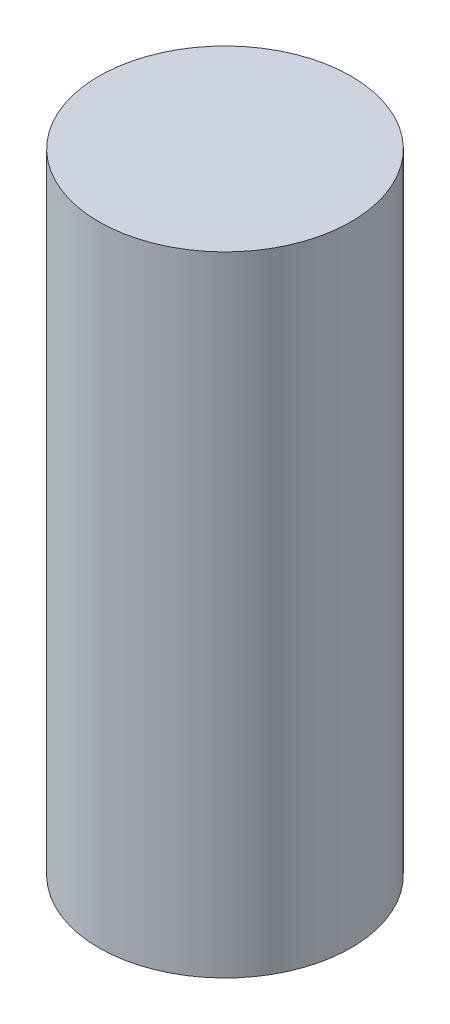
ISO-10303-21;
HEADER;
FILE_DESCRIPTION(('STEP AP214'),'2;1');
FILE_NAME('part.step','',(''),(''),'','','');
FILE_SCHEMA(('AUTOMOTIVE_DESIGN { 1 0 10303 214 1 1 1 1 }'));
ENDSEC;
DATA;
#1=APPLICATION_CONTEXT('core data for automotive mechanical design processes');
#2=APPLICATION_PROTOCOL_DEFINITION('international standard','automotive_design',2000,#1);
#3=PRODUCT_CONTEXT('',#1,'mechanical');
#4=PRODUCT('Part','Part','',(#3));
#5=PRODUCT_RELATED_PRODUCT_CATEGORY('part','',(#4));
#6=PRODUCT_DEFINITION_FORMATION('','',#4);
#7=PRODUCT_DEFINITION_CONTEXT('part definition',#1,'design');
#8=PRODUCT_DEFINITION('design','',#6,#7);
#9=PRODUCT_DEFINITION_SHAPE('','',#8);
#10=(LENGTH_UNIT() NAMED_UNIT(*) SI_UNIT(.MILLI.,.METRE.));
#11=(NAMED_UNIT(*) PLANE_ANGLE_UNIT() SI_UNIT($,.RADIAN.));
#12=(NAMED_UNIT(*) SI_UNIT($,.STERADIAN.) SOLID_ANGLE_UNIT());
#13=UNCERTAINTY_MEASURE_WITH_UNIT(LENGTH_MEASURE(1.E-05),#10,'distance_accuracy_value','');
#14=(GEOMETRIC_REPRESENTATION_CONTEXT(3) GLOBAL_UNCERTAINTY_ASSIGNED_CONTEXT((#13)) GLOBAL_UNIT_ASSIGNED_CONTEXT((#10,
#11,#12)) REPRESENTATION_CONTEXT('',''));
#15=CARTESIAN_POINT('',(0.,0.,0.));
#16=DIRECTION('',(0.,0.,1.));
#17=DIRECTION('',(1.,0.,0.));
#18=AXIS2_PLACEMENT_3D('',#15,#16,#17);
#19=CARTESIAN_POINT('',(0.,15.4813,0.));
#20=DIRECTION('',(0.,-1.,0.));
#21=DIRECTION('',(0.,0.,-1.));
#22=AXIS2_PLACEMENT_3D('',#19,#20,#21);
#23=CYLINDRICAL_SURFACE('',#22,3.10515);
#24=CARTESIAN_POINT('',(0.,15.4813,0.));
#25=DIRECTION('',(0.,1.,0.));
#26=DIRECTION('',(0.,0.,1.));
#27=AXIS2_PLACEMENT_3D('',#24,#25,#26);
#28=CIRCLE('',#27,3.10515);
#29=CARTESIAN_POINT('',(0.,15.4813,3.10515));
#30=VERTEX_POINT('',#29);
#31=EDGE_CURVE('E10',#30,#30,#28,.T.);
#32=ORIENTED_EDGE('',*,*,#31,.F.);
#33=EDGE_LOOP('',(#32));
#34=FACE_BOUND('',#33,.T.);
#35=CARTESIAN_POINT('',(0.,0.,0.));
#36=DIRECTION('',(0.,1.,0.));
#37=DIRECTION('',(0.,0.,1.));
#38=AXIS2_PLACEMENT_3D('',#35,#36,#37);
#39=CIRCLE('',#38,3.10515);
#40=CARTESIAN_POINT('',(0.,0.,3.10515));
#41=VERTEX_POINT('',#40);
#42=EDGE_CURVE('E44',#41,#41,#39,.T.);
#43=ORIENTED_EDGE('',*,*,#42,.T.);
#44=EDGE_LOOP('',(#43));
#45=FACE_BOUND('',#44,.T.);
#46=ADVANCED_FACE('F41',(#34,#45),#23,.T.);
#47=CARTESIAN_POINT('',(0.,15.4813,0.));
#48=DIRECTION('',(0.,1.,0.));
#49=DIRECTION('',(0.,0.,1.));
#50=AXIS2_PLACEMENT_3D('',#47,#48,#49);
#51=PLANE('',#50);
#52=ORIENTED_EDGE('',*,*,#31,.T.);
#53=EDGE_LOOP('',(#52));
#54=FACE_BOUND('',#53,.T.);
#55=ADVANCED_FACE('F58',(#54),#51,.T.);
#56=CARTESIAN_POINT('',(0.,0.,0.));
#57=DIRECTION('',(0.,1.,0.));
#58=DIRECTION('',(0.,0.,1.));
#59=AXIS2_PLACEMENT_3D('',#56,#57,#58);
#60=PLANE('',#59);
#61=ORIENTED_EDGE('',*,*,#42,.F.);
#62=EDGE_LOOP('',(#61));
#63=FACE_BOUND('',#62,.T.);
#64=ADVANCED_FACE('F56',(#63),#60,.F.);
#65=CLOSED_SHELL('',(#46,#55,#64));
#66=MANIFOLD_SOLID_BREP('B2',#65);
#67=ADVANCED_BREP_SHAPE_REPRESENTATION('',(#18,#66),#14);
#68=SHAPE_DEFINITION_REPRESENTATION(#9,#67);
ENDSEC;
END-ISO-10303-21;
